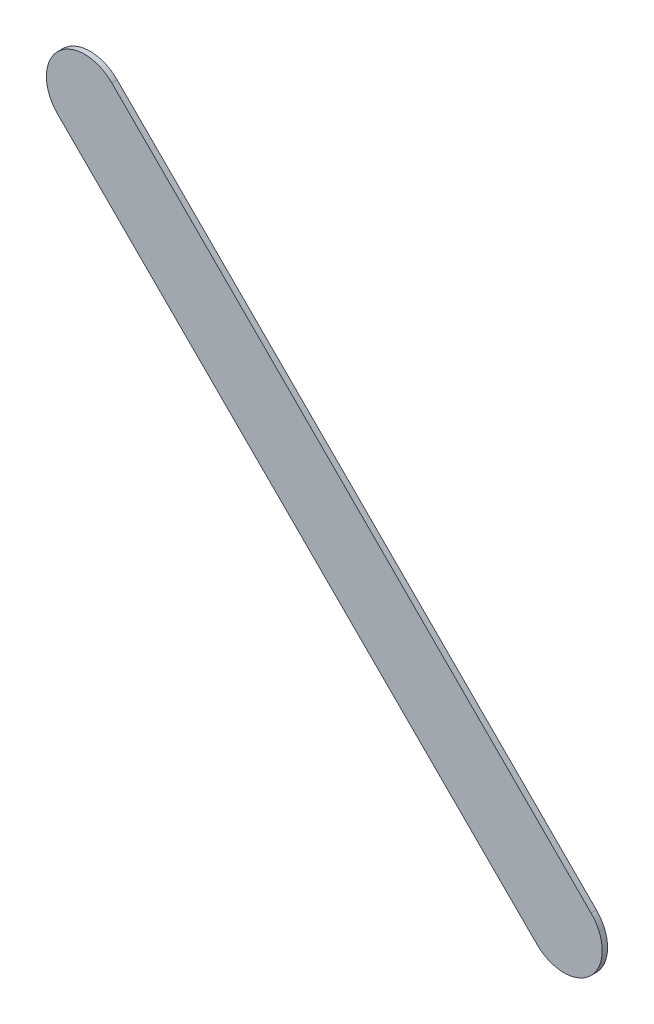
ISO-10303-21;
HEADER;
FILE_DESCRIPTION(('STEP AP214'),'2;1');
FILE_NAME('part.step','',(''),(''),'','','');
FILE_SCHEMA(('AUTOMOTIVE_DESIGN { 1 0 10303 214 1 1 1 1 }'));
ENDSEC;
DATA;
#1=APPLICATION_CONTEXT('core data for automotive mechanical design processes');
#2=APPLICATION_PROTOCOL_DEFINITION('international standard','automotive_design',2000,#1);
#3=PRODUCT_CONTEXT('',#1,'mechanical');
#4=PRODUCT('Part','Part','',(#3));
#5=PRODUCT_RELATED_PRODUCT_CATEGORY('part','',(#4));
#6=PRODUCT_DEFINITION_FORMATION('','',#4);
#7=PRODUCT_DEFINITION_CONTEXT('part definition',#1,'design');
#8=PRODUCT_DEFINITION('design','',#6,#7);
#9=PRODUCT_DEFINITION_SHAPE('','',#8);
#10=(LENGTH_UNIT() NAMED_UNIT(*) SI_UNIT(.MILLI.,.METRE.));
#11=(NAMED_UNIT(*) PLANE_ANGLE_UNIT() SI_UNIT($,.RADIAN.));
#12=(NAMED_UNIT(*) SI_UNIT($,.STERADIAN.) SOLID_ANGLE_UNIT());
#13=UNCERTAINTY_MEASURE_WITH_UNIT(LENGTH_MEASURE(1.E-05),#10,'distance_accuracy_value','');
#14=(GEOMETRIC_REPRESENTATION_CONTEXT(3) GLOBAL_UNCERTAINTY_ASSIGNED_CONTEXT((#13)) GLOBAL_UNIT_ASSIGNED_CONTEXT((#10,
#11,#12)) REPRESENTATION_CONTEXT('',''));
#15=CARTESIAN_POINT('',(0.,0.,0.));
#16=DIRECTION('',(0.,0.,1.));
#17=DIRECTION('',(1.,0.,0.));
#18=AXIS2_PLACEMENT_3D('',#15,#16,#17);
#19=CARTESIAN_POINT('',(173.051223,-124.001776,0.));
#20=DIRECTION('',(0.,0.,1.));
#21=DIRECTION('',(1.,0.,0.));
#22=AXIS2_PLACEMENT_3D('',#19,#20,#21);
#23=PLANE('',#22);
#24=DIRECTION('',(0.707106781186548,-0.707106781186548,0.));
#25=VECTOR('',#24,1.);
#26=CARTESIAN_POINT('',(173.051223,-124.001776,0.));
#27=LINE('',#26,#25);
#28=CARTESIAN_POINT('',(173.051223,-124.001776,0.));
#29=VERTEX_POINT('',#28);
#30=CARTESIAN_POINT('',(176.182223,-127.132776,0.));
#31=VERTEX_POINT('',#30);
#32=EDGE_CURVE('E85',#29,#31,#27,.T.);
#33=ORIENTED_EDGE('',*,*,#32,.T.);
#34=CARTESIAN_POINT('',(176.3589995,-126.9559995,0.));
#35=DIRECTION('',(0.,0.,1.));
#36=DIRECTION('',(-0.707106781186548,-0.707106781186548,0.));
#37=AXIS2_PLACEMENT_3D('',#34,#35,#36);
#38=CIRCLE('',#37,0.249999723809);
#39=CARTESIAN_POINT('',(176.535776,-126.779223,0.));
#40=VERTEX_POINT('',#39);
#41=EDGE_CURVE('E71',#31,#40,#38,.T.);
#42=ORIENTED_EDGE('',*,*,#41,.T.);
#43=DIRECTION('',(-0.707106781186548,0.707106781186548,0.));
#44=VECTOR('',#43,1.);
#45=CARTESIAN_POINT('',(176.535776,-126.779223,0.));
#46=LINE('',#45,#44);
#47=CARTESIAN_POINT('',(173.404776,-123.648223,0.));
#48=VERTEX_POINT('',#47);
#49=EDGE_CURVE('E113',#40,#48,#46,.T.);
#50=ORIENTED_EDGE('',*,*,#49,.T.);
#51=CARTESIAN_POINT('',(173.2279995,-123.8249995,0.));
#52=DIRECTION('',(0.,0.,1.));
#53=DIRECTION('',(0.707106781186548,0.707106781186548,0.));
#54=AXIS2_PLACEMENT_3D('',#51,#52,#53);
#55=CIRCLE('',#54,0.249999723809);
#56=EDGE_CURVE('E11',#48,#29,#55,.T.);
#57=ORIENTED_EDGE('',*,*,#56,.T.);
#58=EDGE_LOOP('',(#33,#42,#50,#57));
#59=FACE_BOUND('',#58,.T.);
#60=ADVANCED_FACE('F17',(#59),#23,.T.);
#61=CARTESIAN_POINT('',(173.051223,-124.001776,-0.035));
#62=DIRECTION('',(0.,0.,1.));
#63=DIRECTION('',(1.,0.,0.));
#64=AXIS2_PLACEMENT_3D('',#61,#62,#63);
#65=PLANE('',#64);
#66=CARTESIAN_POINT('',(173.2279995,-123.8249995,-0.035));
#67=DIRECTION('',(0.,0.,1.));
#68=DIRECTION('',(0.707106781186548,0.707106781186548,0.));
#69=AXIS2_PLACEMENT_3D('',#66,#67,#68);
#70=CIRCLE('',#69,0.249999723809);
#71=CARTESIAN_POINT('',(173.404776,-123.648223,-0.035));
#72=VERTEX_POINT('',#71);
#73=CARTESIAN_POINT('',(173.051223,-124.001776,-0.035));
#74=VERTEX_POINT('',#73);
#75=EDGE_CURVE('E20',#72,#74,#70,.T.);
#76=ORIENTED_EDGE('',*,*,#75,.F.);
#77=DIRECTION('',(-0.707106781186548,0.707106781186548,0.));
#78=VECTOR('',#77,1.);
#79=CARTESIAN_POINT('',(176.535776,-126.779223,-0.035));
#80=LINE('',#79,#78);
#81=CARTESIAN_POINT('',(176.535776,-126.779223,-0.035));
#82=VERTEX_POINT('',#81);
#83=EDGE_CURVE('E82',#82,#72,#80,.T.);
#84=ORIENTED_EDGE('',*,*,#83,.F.);
#85=CARTESIAN_POINT('',(176.3589995,-126.9559995,-0.035));
#86=DIRECTION('',(0.,0.,1.));
#87=DIRECTION('',(-0.707106781186548,-0.707106781186548,0.));
#88=AXIS2_PLACEMENT_3D('',#85,#86,#87);
#89=CIRCLE('',#88,0.249999723809);
#90=CARTESIAN_POINT('',(176.182223,-127.132776,-0.035));
#91=VERTEX_POINT('',#90);
#92=EDGE_CURVE('E107',#91,#82,#89,.T.);
#93=ORIENTED_EDGE('',*,*,#92,.F.);
#94=DIRECTION('',(0.707106781186548,-0.707106781186548,0.));
#95=VECTOR('',#94,1.);
#96=CARTESIAN_POINT('',(173.051223,-124.001776,-0.035));
#97=LINE('',#96,#95);
#98=EDGE_CURVE('E92',#74,#91,#97,.T.);
#99=ORIENTED_EDGE('',*,*,#98,.F.);
#100=EDGE_LOOP('',(#76,#84,#93,#99));
#101=FACE_BOUND('',#100,.T.);
#102=ADVANCED_FACE('F121',(#101),#65,.F.);
#103=CARTESIAN_POINT('',(173.2279995,-123.8249995,-0.035));
#104=DIRECTION('',(0.,0.,-1.));
#105=DIRECTION('',(0.707106781186548,0.707106781186548,0.));
#106=AXIS2_PLACEMENT_3D('',#103,#104,#105);
#107=CYLINDRICAL_SURFACE('',#106,0.249999723809);
#108=ORIENTED_EDGE('',*,*,#75,.T.);
#109=DIRECTION('',(0.,0.,1.));
#110=VECTOR('',#109,1.);
#111=CARTESIAN_POINT('',(173.051223,-124.001776,-0.035));
#112=LINE('',#111,#110);
#113=EDGE_CURVE('E89',#74,#29,#112,.T.);
#114=ORIENTED_EDGE('',*,*,#113,.T.);
#115=ORIENTED_EDGE('',*,*,#56,.F.);
#116=DIRECTION('',(0.,0.,1.));
#117=VECTOR('',#116,1.);
#118=CARTESIAN_POINT('',(173.404776,-123.648223,-0.035));
#119=LINE('',#118,#117);
#120=EDGE_CURVE('E105',#72,#48,#119,.T.);
#121=ORIENTED_EDGE('',*,*,#120,.F.);
#122=EDGE_LOOP('',(#108,#114,#115,#121));
#123=FACE_BOUND('',#122,.T.);
#124=ADVANCED_FACE('F120',(#123),#107,.T.);
#125=CARTESIAN_POINT('',(176.535776,-126.779223,-0.035));
#126=DIRECTION('',(-0.707106781186548,-0.707106781186548,0.));
#127=DIRECTION('',(-0.707106781186548,0.707106781186548,0.));
#128=AXIS2_PLACEMENT_3D('',#125,#126,#127);
#129=PLANE('',#128);
#130=ORIENTED_EDGE('',*,*,#83,.T.);
#131=ORIENTED_EDGE('',*,*,#120,.T.);
#132=ORIENTED_EDGE('',*,*,#49,.F.);
#133=DIRECTION('',(0.,0.,1.));
#134=VECTOR('',#133,1.);
#135=CARTESIAN_POINT('',(176.535776,-126.779223,-0.035));
#136=LINE('',#135,#134);
#137=EDGE_CURVE('E79',#82,#40,#136,.T.);
#138=ORIENTED_EDGE('',*,*,#137,.F.);
#139=EDGE_LOOP('',(#130,#131,#132,#138));
#140=FACE_BOUND('',#139,.T.);
#141=ADVANCED_FACE('F123',(#140),#129,.F.);
#142=CARTESIAN_POINT('',(176.3589995,-126.9559995,-0.035));
#143=DIRECTION('',(0.,0.,-1.));
#144=DIRECTION('',(-0.707106781186548,-0.707106781186548,0.));
#145=AXIS2_PLACEMENT_3D('',#142,#143,#144);
#146=CYLINDRICAL_SURFACE('',#145,0.249999723809);
#147=ORIENTED_EDGE('',*,*,#92,.T.);
#148=ORIENTED_EDGE('',*,*,#137,.T.);
#149=ORIENTED_EDGE('',*,*,#41,.F.);
#150=DIRECTION('',(0.,0.,1.));
#151=VECTOR('',#150,1.);
#152=CARTESIAN_POINT('',(176.182223,-127.132776,-0.035));
#153=LINE('',#152,#151);
#154=EDGE_CURVE('E76',#91,#31,#153,.T.);
#155=ORIENTED_EDGE('',*,*,#154,.F.);
#156=EDGE_LOOP('',(#147,#148,#149,#155));
#157=FACE_BOUND('',#156,.T.);
#158=ADVANCED_FACE('F74',(#157),#146,.T.);
#159=CARTESIAN_POINT('',(173.051223,-124.001776,-0.035));
#160=DIRECTION('',(0.707106781186548,0.707106781186548,0.));
#161=DIRECTION('',(0.,0.,-1.));
#162=AXIS2_PLACEMENT_3D('',#159,#160,#161);
#163=PLANE('',#162);
#164=ORIENTED_EDGE('',*,*,#98,.T.);
#165=ORIENTED_EDGE('',*,*,#154,.T.);
#166=ORIENTED_EDGE('',*,*,#32,.F.);
#167=ORIENTED_EDGE('',*,*,#113,.F.);
#168=EDGE_LOOP('',(#164,#165,#166,#167));
#169=FACE_BOUND('',#168,.T.);
#170=ADVANCED_FACE('F91',(#169),#163,.F.);
#171=CLOSED_SHELL('',(#60,#102,#124,#141,#158,#170));
#172=MANIFOLD_SOLID_BREP('B1',#171);
#173=ADVANCED_BREP_SHAPE_REPRESENTATION('',(#18,#172),#14);
#174=SHAPE_DEFINITION_REPRESENTATION(#9,#173);
ENDSEC;
END-ISO-10303-21;
